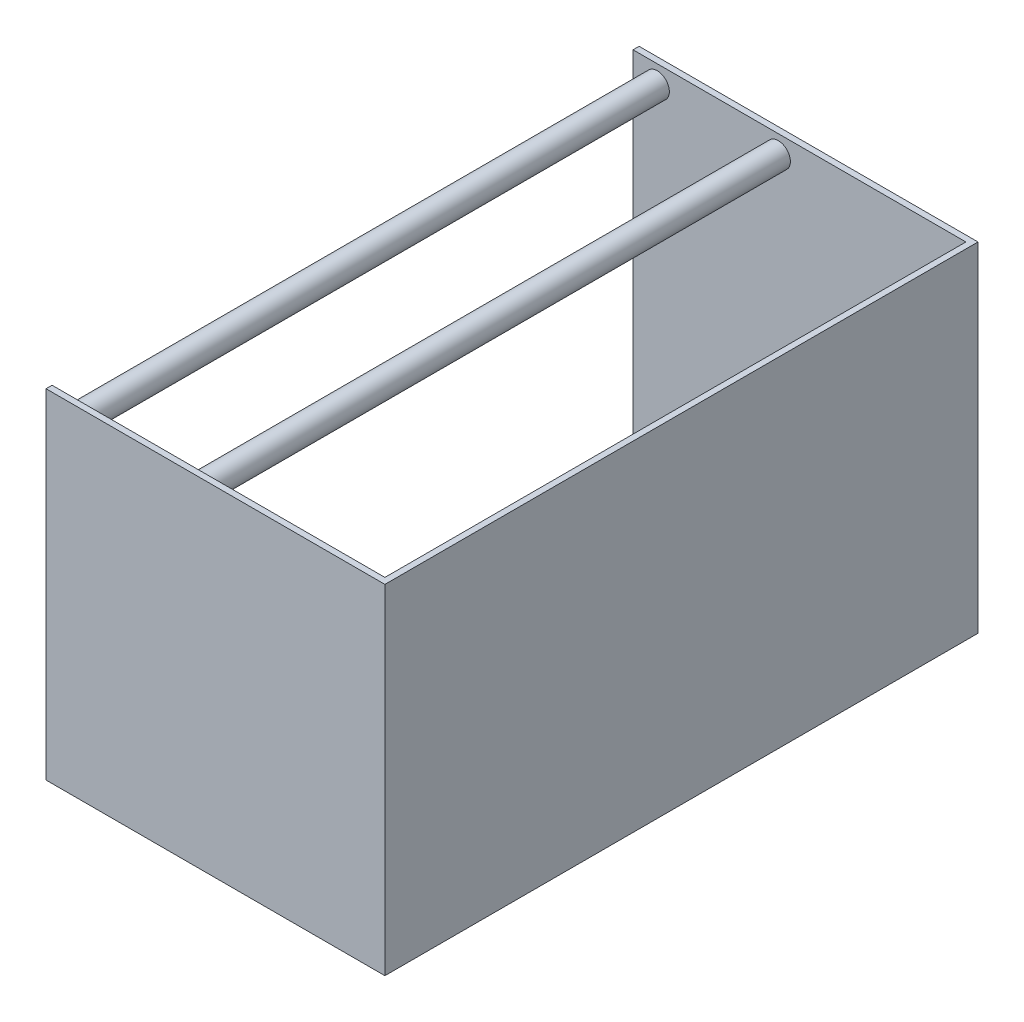
ISO-10303-21;
HEADER;
FILE_DESCRIPTION(('STEP AP214'),'2;1');
FILE_NAME('part.step','',(''),(''),'','','');
FILE_SCHEMA(('AUTOMOTIVE_DESIGN { 1 0 10303 214 1 1 1 1 }'));
ENDSEC;
DATA;
#1=APPLICATION_CONTEXT('core data for automotive mechanical design processes');
#2=APPLICATION_PROTOCOL_DEFINITION('international standard','automotive_design',2000,#1);
#3=PRODUCT_CONTEXT('',#1,'mechanical');
#4=PRODUCT('Part','Part','',(#3));
#5=PRODUCT_RELATED_PRODUCT_CATEGORY('part','',(#4));
#6=PRODUCT_DEFINITION_FORMATION('','',#4);
#7=PRODUCT_DEFINITION_CONTEXT('part definition',#1,'design');
#8=PRODUCT_DEFINITION('design','',#6,#7);
#9=PRODUCT_DEFINITION_SHAPE('','',#8);
#10=(LENGTH_UNIT() NAMED_UNIT(*) SI_UNIT(.MILLI.,.METRE.));
#11=(NAMED_UNIT(*) PLANE_ANGLE_UNIT() SI_UNIT($,.RADIAN.));
#12=(NAMED_UNIT(*) SI_UNIT($,.STERADIAN.) SOLID_ANGLE_UNIT());
#13=UNCERTAINTY_MEASURE_WITH_UNIT(LENGTH_MEASURE(1.E-05),#10,'distance_accuracy_value','');
#14=(GEOMETRIC_REPRESENTATION_CONTEXT(3) GLOBAL_UNCERTAINTY_ASSIGNED_CONTEXT((#13)) GLOBAL_UNIT_ASSIGNED_CONTEXT((#10,
#11,#12)) REPRESENTATION_CONTEXT('',''));
#15=CARTESIAN_POINT('',(0.,0.,0.));
#16=DIRECTION('',(0.,0.,1.));
#17=DIRECTION('',(1.,0.,0.));
#18=AXIS2_PLACEMENT_3D('',#15,#16,#17);
#19=CARTESIAN_POINT('',(0.,355.6,0.));
#20=DIRECTION('',(1.,0.,0.));
#21=DIRECTION('',(0.,0.,-1.));
#22=AXIS2_PLACEMENT_3D('',#19,#20,#21);
#23=PLANE('',#22);
#24=DIRECTION('',(0.,-1.,0.));
#25=VECTOR('',#24,1.);
#26=CARTESIAN_POINT('',(0.,355.6,-615.95));
#27=LINE('',#26,#25);
#28=CARTESIAN_POINT('',(0.,355.6,-615.95));
#29=VERTEX_POINT('',#28);
#30=CARTESIAN_POINT('',(0.,0.,-615.95));
#31=VERTEX_POINT('',#30);
#32=EDGE_CURVE('E190',#29,#31,#27,.T.);
#33=ORIENTED_EDGE('',*,*,#32,.F.);
#34=DIRECTION('',(0.,0.,1.));
#35=VECTOR('',#34,1.);
#36=CARTESIAN_POINT('',(0.,355.6,0.));
#37=LINE('',#36,#35);
#38=CARTESIAN_POINT('',(0.,355.6,-622.3));
#39=VERTEX_POINT('',#38);
#40=EDGE_CURVE('E209',#39,#29,#37,.T.);
#41=ORIENTED_EDGE('',*,*,#40,.F.);
#42=DIRECTION('',(0.,-1.,0.));
#43=VECTOR('',#42,1.);
#44=CARTESIAN_POINT('',(0.,355.6,-622.3));
#45=LINE('',#44,#43);
#46=CARTESIAN_POINT('',(0.,0.,-622.3));
#47=VERTEX_POINT('',#46);
#48=EDGE_CURVE('E160',#39,#47,#45,.T.);
#49=ORIENTED_EDGE('',*,*,#48,.T.);
#50=DIRECTION('',(0.,0.,1.));
#51=VECTOR('',#50,1.);
#52=CARTESIAN_POINT('',(0.,0.,0.));
#53=LINE('',#52,#51);
#54=EDGE_CURVE('E146',#47,#31,#53,.T.);
#55=ORIENTED_EDGE('',*,*,#54,.T.);
#56=EDGE_LOOP('',(#33,#41,#49,#55));
#57=FACE_BOUND('',#56,.T.);
#58=ADVANCED_FACE('F49',(#57),#23,.F.);
#59=CARTESIAN_POINT('',(0.,355.6,0.));
#60=DIRECTION('',(0.,-1.,0.));
#61=DIRECTION('',(0.,0.,-1.));
#62=AXIS2_PLACEMENT_3D('',#59,#60,#61);
#63=PLANE('',#62);
#64=DIRECTION('',(1.,0.,0.));
#65=VECTOR('',#64,1.);
#66=CARTESIAN_POINT('',(0.,355.6,-6.35));
#67=LINE('',#66,#65);
#68=CARTESIAN_POINT('',(0.,355.6,-6.35));
#69=VERTEX_POINT('',#68);
#70=CARTESIAN_POINT('',(349.25,355.6,-6.35));
#71=VERTEX_POINT('',#70);
#72=EDGE_CURVE('E192',#69,#71,#67,.T.);
#73=ORIENTED_EDGE('',*,*,#72,.F.);
#74=CARTESIAN_POINT('',(0.,355.6,0.));
#75=VERTEX_POINT('',#74);
#76=EDGE_CURVE('E103',#69,#75,#37,.T.);
#77=ORIENTED_EDGE('',*,*,#76,.T.);
#78=DIRECTION('',(1.,0.,0.));
#79=VECTOR('',#78,1.);
#80=CARTESIAN_POINT('',(0.,355.6,0.));
#81=LINE('',#80,#79);
#82=CARTESIAN_POINT('',(355.6,355.6,0.));
#83=VERTEX_POINT('',#82);
#84=EDGE_CURVE('E212',#75,#83,#81,.T.);
#85=ORIENTED_EDGE('',*,*,#84,.T.);
#86=DIRECTION('',(0.,0.,-1.));
#87=VECTOR('',#86,1.);
#88=CARTESIAN_POINT('',(355.6,355.6,0.));
#89=LINE('',#88,#87);
#90=CARTESIAN_POINT('',(355.6,355.6,-622.3));
#91=VERTEX_POINT('',#90);
#92=EDGE_CURVE('E214',#83,#91,#89,.T.);
#93=ORIENTED_EDGE('',*,*,#92,.T.);
#94=DIRECTION('',(-1.,0.,0.));
#95=VECTOR('',#94,1.);
#96=CARTESIAN_POINT('',(0.,355.6,-622.3));
#97=LINE('',#96,#95);
#98=EDGE_CURVE('E75',#91,#39,#97,.T.);
#99=ORIENTED_EDGE('',*,*,#98,.T.);
#100=ORIENTED_EDGE('',*,*,#40,.T.);
#101=DIRECTION('',(-1.,0.,0.));
#102=VECTOR('',#101,1.);
#103=CARTESIAN_POINT('',(0.,355.6,-615.95));
#104=LINE('',#103,#102);
#105=CARTESIAN_POINT('',(349.25,355.6,-615.95));
#106=VERTEX_POINT('',#105);
#107=EDGE_CURVE('E199',#106,#29,#104,.T.);
#108=ORIENTED_EDGE('',*,*,#107,.F.);
#109=DIRECTION('',(0.,0.,-1.));
#110=VECTOR('',#109,1.);
#111=CARTESIAN_POINT('',(349.25,355.6,0.));
#112=LINE('',#111,#110);
#113=EDGE_CURVE('E195',#71,#106,#112,.T.);
#114=ORIENTED_EDGE('',*,*,#113,.F.);
#115=EDGE_LOOP('',(#73,#77,#85,#93,#99,#100,#108,#114));
#116=FACE_BOUND('',#115,.T.);
#117=ADVANCED_FACE('F219',(#116),#63,.F.);
#118=CARTESIAN_POINT('',(0.,0.,0.));
#119=DIRECTION('',(0.,-1.,0.));
#120=DIRECTION('',(0.,0.,-1.));
#121=AXIS2_PLACEMENT_3D('',#118,#119,#120);
#122=PLANE('',#121);
#123=DIRECTION('',(0.,0.,-1.));
#124=VECTOR('',#123,1.);
#125=CARTESIAN_POINT('',(349.25,0.,0.));
#126=LINE('',#125,#124);
#127=CARTESIAN_POINT('',(349.25,0.,-6.35));
#128=VERTEX_POINT('',#127);
#129=CARTESIAN_POINT('',(349.25,0.,-615.95));
#130=VERTEX_POINT('',#129);
#131=EDGE_CURVE('E66',#128,#130,#126,.T.);
#132=ORIENTED_EDGE('',*,*,#131,.T.);
#133=DIRECTION('',(-1.,0.,0.));
#134=VECTOR('',#133,1.);
#135=CARTESIAN_POINT('',(0.,0.,-615.95));
#136=LINE('',#135,#134);
#137=EDGE_CURVE('E196',#130,#31,#136,.T.);
#138=ORIENTED_EDGE('',*,*,#137,.T.);
#139=ORIENTED_EDGE('',*,*,#54,.F.);
#140=DIRECTION('',(-1.,0.,0.));
#141=VECTOR('',#140,1.);
#142=CARTESIAN_POINT('',(0.,0.,-622.3));
#143=LINE('',#142,#141);
#144=CARTESIAN_POINT('',(355.6,0.,-622.3));
#145=VERTEX_POINT('',#144);
#146=EDGE_CURVE('E96',#145,#47,#143,.T.);
#147=ORIENTED_EDGE('',*,*,#146,.F.);
#148=DIRECTION('',(0.,0.,-1.));
#149=VECTOR('',#148,1.);
#150=CARTESIAN_POINT('',(355.6,0.,0.));
#151=LINE('',#150,#149);
#152=CARTESIAN_POINT('',(355.6,0.,0.));
#153=VERTEX_POINT('',#152);
#154=EDGE_CURVE('E155',#153,#145,#151,.T.);
#155=ORIENTED_EDGE('',*,*,#154,.F.);
#156=DIRECTION('',(1.,0.,0.));
#157=VECTOR('',#156,1.);
#158=CARTESIAN_POINT('',(0.,0.,0.));
#159=LINE('',#158,#157);
#160=CARTESIAN_POINT('',(0.,0.,0.));
#161=VERTEX_POINT('',#160);
#162=EDGE_CURVE('E143',#161,#153,#159,.T.);
#163=ORIENTED_EDGE('',*,*,#162,.F.);
#164=CARTESIAN_POINT('',(0.,0.,-6.35));
#165=VERTEX_POINT('',#164);
#166=EDGE_CURVE('E137',#165,#161,#53,.T.);
#167=ORIENTED_EDGE('',*,*,#166,.F.);
#168=DIRECTION('',(1.,0.,0.));
#169=VECTOR('',#168,1.);
#170=CARTESIAN_POINT('',(0.,0.,-6.35));
#171=LINE('',#170,#169);
#172=EDGE_CURVE('E126',#165,#128,#171,.T.);
#173=ORIENTED_EDGE('',*,*,#172,.T.);
#174=EDGE_LOOP('',(#132,#138,#139,#147,#155,#163,#167,#173));
#175=FACE_BOUND('',#174,.T.);
#176=ADVANCED_FACE('F141',(#175),#122,.T.);
#177=ORIENTED_EDGE('',*,*,#76,.F.);
#178=DIRECTION('',(0.,-1.,0.));
#179=VECTOR('',#178,1.);
#180=CARTESIAN_POINT('',(0.,355.6,-6.35));
#181=LINE('',#180,#179);
#182=EDGE_CURVE('E129',#69,#165,#181,.T.);
#183=ORIENTED_EDGE('',*,*,#182,.T.);
#184=ORIENTED_EDGE('',*,*,#166,.T.);
#185=DIRECTION('',(0.,-1.,0.));
#186=VECTOR('',#185,1.);
#187=CARTESIAN_POINT('',(0.,355.6,0.));
#188=LINE('',#187,#186);
#189=EDGE_CURVE('E170',#75,#161,#188,.T.);
#190=ORIENTED_EDGE('',*,*,#189,.F.);
#191=EDGE_LOOP('',(#177,#183,#184,#190));
#192=FACE_BOUND('',#191,.T.);
#193=ADVANCED_FACE('F51',(#192),#23,.F.);
#194=CARTESIAN_POINT('',(0.,355.6,0.));
#195=DIRECTION('',(0.,0.,-1.));
#196=DIRECTION('',(-1.,0.,0.));
#197=AXIS2_PLACEMENT_3D('',#194,#195,#196);
#198=PLANE('',#197);
#199=ORIENTED_EDGE('',*,*,#162,.T.);
#200=DIRECTION('',(0.,-1.,0.));
#201=VECTOR('',#200,1.);
#202=CARTESIAN_POINT('',(355.6,355.6,0.));
#203=LINE('',#202,#201);
#204=EDGE_CURVE('E166',#83,#153,#203,.T.);
#205=ORIENTED_EDGE('',*,*,#204,.F.);
#206=ORIENTED_EDGE('',*,*,#84,.F.);
#207=ORIENTED_EDGE('',*,*,#189,.T.);
#208=EDGE_LOOP('',(#199,#205,#206,#207));
#209=FACE_BOUND('',#208,.T.);
#210=ADVANCED_FACE('F255',(#209),#198,.F.);
#211=CARTESIAN_POINT('',(355.6,355.6,0.));
#212=DIRECTION('',(-1.,0.,0.));
#213=DIRECTION('',(0.,0.,1.));
#214=AXIS2_PLACEMENT_3D('',#211,#212,#213);
#215=PLANE('',#214);
#216=ORIENTED_EDGE('',*,*,#154,.T.);
#217=DIRECTION('',(0.,-1.,0.));
#218=VECTOR('',#217,1.);
#219=CARTESIAN_POINT('',(355.6,355.6,-622.3));
#220=LINE('',#219,#218);
#221=EDGE_CURVE('E163',#91,#145,#220,.T.);
#222=ORIENTED_EDGE('',*,*,#221,.F.);
#223=ORIENTED_EDGE('',*,*,#92,.F.);
#224=ORIENTED_EDGE('',*,*,#204,.T.);
#225=EDGE_LOOP('',(#216,#222,#223,#224));
#226=FACE_BOUND('',#225,.T.);
#227=ADVANCED_FACE('F222',(#226),#215,.F.);
#228=CARTESIAN_POINT('',(0.,355.6,-622.3));
#229=DIRECTION('',(0.,0.,1.));
#230=DIRECTION('',(1.,0.,0.));
#231=AXIS2_PLACEMENT_3D('',#228,#229,#230);
#232=PLANE('',#231);
#233=ORIENTED_EDGE('',*,*,#146,.T.);
#234=ORIENTED_EDGE('',*,*,#48,.F.);
#235=ORIENTED_EDGE('',*,*,#98,.F.);
#236=ORIENTED_EDGE('',*,*,#221,.T.);
#237=EDGE_LOOP('',(#233,#234,#235,#236));
#238=FACE_BOUND('',#237,.T.);
#239=ADVANCED_FACE('F223',(#238),#232,.F.);
#240=CARTESIAN_POINT('',(0.,355.6,-6.35));
#241=DIRECTION('',(0.,0.,-1.));
#242=DIRECTION('',(-1.,0.,0.));
#243=AXIS2_PLACEMENT_3D('',#240,#241,#242);
#244=PLANE('',#243);
#245=CARTESIAN_POINT('',(25.4,336.55,-6.35));
#246=DIRECTION('',(0.,0.,-1.));
#247=DIRECTION('',(-1.,0.,0.));
#248=AXIS2_PLACEMENT_3D('',#245,#246,#247);
#249=CIRCLE('',#248,12.7);
#250=CARTESIAN_POINT('',(12.7,336.55,-6.35));
#251=VERTEX_POINT('',#250);
#252=EDGE_CURVE('E11',#251,#251,#249,.T.);
#253=ORIENTED_EDGE('',*,*,#252,.F.);
#254=EDGE_LOOP('',(#253));
#255=FACE_BOUND('',#254,.T.);
#256=CARTESIAN_POINT('',(152.4,336.55,-6.35));
#257=DIRECTION('',(0.,0.,-1.));
#258=DIRECTION('',(-1.,0.,0.));
#259=AXIS2_PLACEMENT_3D('',#256,#257,#258);
#260=CIRCLE('',#259,12.7);
#261=CARTESIAN_POINT('',(139.7,336.55,-6.35));
#262=VERTEX_POINT('',#261);
#263=EDGE_CURVE('E175',#262,#262,#260,.T.);
#264=ORIENTED_EDGE('',*,*,#263,.F.);
#265=EDGE_LOOP('',(#264));
#266=FACE_BOUND('',#265,.T.);
#267=ORIENTED_EDGE('',*,*,#172,.F.);
#268=ORIENTED_EDGE('',*,*,#182,.F.);
#269=ORIENTED_EDGE('',*,*,#72,.T.);
#270=DIRECTION('',(0.,-1.,0.));
#271=VECTOR('',#270,1.);
#272=CARTESIAN_POINT('',(349.25,355.6,-6.35));
#273=LINE('',#272,#271);
#274=EDGE_CURVE('E130',#71,#128,#273,.T.);
#275=ORIENTED_EDGE('',*,*,#274,.T.);
#276=EDGE_LOOP('',(#267,#268,#269,#275));
#277=FACE_BOUND('',#276,.T.);
#278=ADVANCED_FACE('F128',(#255,#266,#277),#244,.T.);
#279=CARTESIAN_POINT('',(349.25,355.6,0.));
#280=DIRECTION('',(-1.,0.,0.));
#281=DIRECTION('',(0.,0.,1.));
#282=AXIS2_PLACEMENT_3D('',#279,#280,#281);
#283=PLANE('',#282);
#284=ORIENTED_EDGE('',*,*,#131,.F.);
#285=ORIENTED_EDGE('',*,*,#274,.F.);
#286=ORIENTED_EDGE('',*,*,#113,.T.);
#287=DIRECTION('',(0.,-1.,0.));
#288=VECTOR('',#287,1.);
#289=CARTESIAN_POINT('',(349.25,355.6,-615.95));
#290=LINE('',#289,#288);
#291=EDGE_CURVE('E188',#106,#130,#290,.T.);
#292=ORIENTED_EDGE('',*,*,#291,.T.);
#293=EDGE_LOOP('',(#284,#285,#286,#292));
#294=FACE_BOUND('',#293,.T.);
#295=ADVANCED_FACE('F234',(#294),#283,.T.);
#296=CARTESIAN_POINT('',(0.,355.6,-615.95));
#297=DIRECTION('',(0.,0.,1.));
#298=DIRECTION('',(1.,0.,0.));
#299=AXIS2_PLACEMENT_3D('',#296,#297,#298);
#300=PLANE('',#299);
#301=CARTESIAN_POINT('',(25.4,336.55,-615.95));
#302=DIRECTION('',(0.,0.,1.));
#303=DIRECTION('',(1.,0.,0.));
#304=AXIS2_PLACEMENT_3D('',#301,#302,#303);
#305=CIRCLE('',#304,12.7);
#306=CARTESIAN_POINT('',(38.1,336.55,-615.95));
#307=VERTEX_POINT('',#306);
#308=EDGE_CURVE('E53',#307,#307,#305,.T.);
#309=ORIENTED_EDGE('',*,*,#308,.F.);
#310=EDGE_LOOP('',(#309));
#311=FACE_BOUND('',#310,.T.);
#312=CARTESIAN_POINT('',(152.4,336.55,-615.95));
#313=DIRECTION('',(0.,0.,1.));
#314=DIRECTION('',(1.,0.,0.));
#315=AXIS2_PLACEMENT_3D('',#312,#313,#314);
#316=CIRCLE('',#315,12.7);
#317=CARTESIAN_POINT('',(165.1,336.55,-615.95));
#318=VERTEX_POINT('',#317);
#319=EDGE_CURVE('E172',#318,#318,#316,.T.);
#320=ORIENTED_EDGE('',*,*,#319,.F.);
#321=EDGE_LOOP('',(#320));
#322=FACE_BOUND('',#321,.T.);
#323=ORIENTED_EDGE('',*,*,#137,.F.);
#324=ORIENTED_EDGE('',*,*,#291,.F.);
#325=ORIENTED_EDGE('',*,*,#107,.T.);
#326=ORIENTED_EDGE('',*,*,#32,.T.);
#327=EDGE_LOOP('',(#323,#324,#325,#326));
#328=FACE_BOUND('',#327,.T.);
#329=ADVANCED_FACE('F233',(#311,#322,#328),#300,.T.);
#330=CARTESIAN_POINT('',(152.4,336.55,35.9210244842766));
#331=DIRECTION('',(0.,0.,-1.));
#332=DIRECTION('',(-1.,0.,0.));
#333=AXIS2_PLACEMENT_3D('',#330,#331,#332);
#334=CYLINDRICAL_SURFACE('',#333,12.7);
#335=ORIENTED_EDGE('',*,*,#263,.T.);
#336=EDGE_LOOP('',(#335));
#337=FACE_BOUND('',#336,.T.);
#338=ORIENTED_EDGE('',*,*,#319,.T.);
#339=EDGE_LOOP('',(#338));
#340=FACE_BOUND('',#339,.T.);
#341=ADVANCED_FACE('F242',(#337,#340),#334,.T.);
#342=CARTESIAN_POINT('',(25.4,336.55,35.9210244842766));
#343=DIRECTION('',(0.,0.,-1.));
#344=DIRECTION('',(-1.,0.,0.));
#345=AXIS2_PLACEMENT_3D('',#342,#343,#344);
#346=CYLINDRICAL_SURFACE('',#345,12.7);
#347=ORIENTED_EDGE('',*,*,#252,.T.);
#348=EDGE_LOOP('',(#347));
#349=FACE_BOUND('',#348,.T.);
#350=ORIENTED_EDGE('',*,*,#308,.T.);
#351=EDGE_LOOP('',(#350));
#352=FACE_BOUND('',#351,.T.);
#353=ADVANCED_FACE('F325',(#349,#352),#346,.T.);
#354=CLOSED_SHELL('',(#58,#117,#176,#193,#210,#227,#239,#278,#295,#329,#341,#353));
#355=MANIFOLD_SOLID_BREP('B2',#354);
#356=ADVANCED_BREP_SHAPE_REPRESENTATION('',(#18,#355),#14);
#357=SHAPE_DEFINITION_REPRESENTATION(#9,#356);
ENDSEC;
END-ISO-10303-21;
